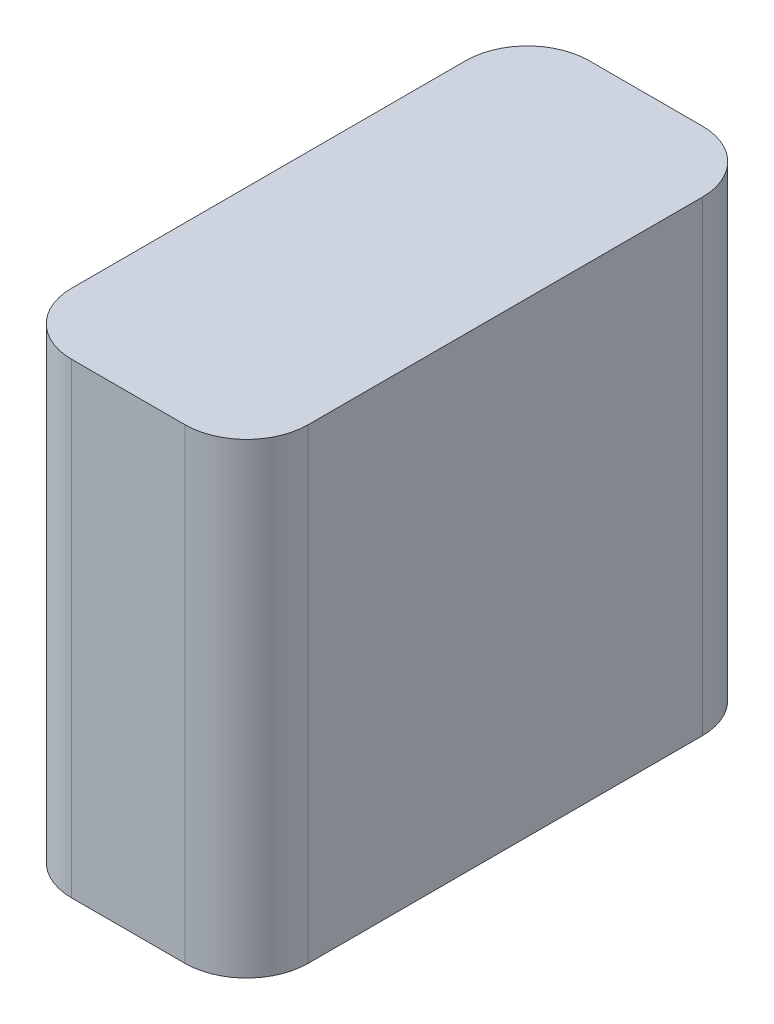
ISO-10303-21;
HEADER;
FILE_DESCRIPTION(('STEP AP214'),'2;1');
FILE_NAME('part.step','',(''),(''),'','','');
FILE_SCHEMA(('AUTOMOTIVE_DESIGN { 1 0 10303 214 1 1 1 1 }'));
ENDSEC;
DATA;
#1=APPLICATION_CONTEXT('core data for automotive mechanical design processes');
#2=APPLICATION_PROTOCOL_DEFINITION('international standard','automotive_design',2000,#1);
#3=PRODUCT_CONTEXT('',#1,'mechanical');
#4=PRODUCT('Part','Part','',(#3));
#5=PRODUCT_RELATED_PRODUCT_CATEGORY('part','',(#4));
#6=PRODUCT_DEFINITION_FORMATION('','',#4);
#7=PRODUCT_DEFINITION_CONTEXT('part definition',#1,'design');
#8=PRODUCT_DEFINITION('design','',#6,#7);
#9=PRODUCT_DEFINITION_SHAPE('','',#8);
#10=(LENGTH_UNIT() NAMED_UNIT(*) SI_UNIT(.MILLI.,.METRE.));
#11=(NAMED_UNIT(*) PLANE_ANGLE_UNIT() SI_UNIT($,.RADIAN.));
#12=(NAMED_UNIT(*) SI_UNIT($,.STERADIAN.) SOLID_ANGLE_UNIT());
#13=UNCERTAINTY_MEASURE_WITH_UNIT(LENGTH_MEASURE(1.E-05),#10,'distance_accuracy_value','');
#14=(GEOMETRIC_REPRESENTATION_CONTEXT(3) GLOBAL_UNCERTAINTY_ASSIGNED_CONTEXT((#13)) GLOBAL_UNIT_ASSIGNED_CONTEXT((#10,
#11,#12)) REPRESENTATION_CONTEXT('',''));
#15=CARTESIAN_POINT('',(0.,0.,0.));
#16=DIRECTION('',(0.,0.,1.));
#17=DIRECTION('',(1.,0.,0.));
#18=AXIS2_PLACEMENT_3D('',#15,#16,#17);
#19=CARTESIAN_POINT('',(7.49935000000001,56.7436,55.42915));
#20=DIRECTION('',(0.,-1.,0.));
#21=DIRECTION('',(0.,0.,-1.));
#22=AXIS2_PLACEMENT_3D('',#19,#20,#21);
#23=CYLINDRICAL_SURFACE('',#22,7.49935);
#24=CARTESIAN_POINT('',(7.49935000000001,0.,55.42915));
#25=DIRECTION('',(0.,1.,0.));
#26=DIRECTION('',(0.,0.,1.));
#27=AXIS2_PLACEMENT_3D('',#24,#25,#26);
#28=CIRCLE('',#27,7.49935);
#29=CARTESIAN_POINT('',(0.,0.,55.42915));
#30=VERTEX_POINT('',#29);
#31=CARTESIAN_POINT('',(7.49935000000006,0.,62.9285));
#32=VERTEX_POINT('',#31);
#33=EDGE_CURVE('E133',#30,#32,#28,.T.);
#34=ORIENTED_EDGE('',*,*,#33,.T.);
#35=DIRECTION('',(0.,-1.,0.));
#36=VECTOR('',#35,1.);
#37=CARTESIAN_POINT('',(7.49935000000006,56.7436,62.9285));
#38=LINE('',#37,#36);
#39=CARTESIAN_POINT('',(7.49935000000006,56.7436,62.9285));
#40=VERTEX_POINT('',#39);
#41=EDGE_CURVE('E11',#40,#32,#38,.T.);
#42=ORIENTED_EDGE('',*,*,#41,.F.);
#43=CARTESIAN_POINT('',(7.49935000000001,56.7436,55.42915));
#44=DIRECTION('',(0.,1.,0.));
#45=DIRECTION('',(0.,0.,1.));
#46=AXIS2_PLACEMENT_3D('',#43,#44,#45);
#47=CIRCLE('',#46,7.49935);
#48=CARTESIAN_POINT('',(0.,56.7436,55.42915));
#49=VERTEX_POINT('',#48);
#50=EDGE_CURVE('E147',#49,#40,#47,.T.);
#51=ORIENTED_EDGE('',*,*,#50,.F.);
#52=DIRECTION('',(0.,-1.,0.));
#53=VECTOR('',#52,1.);
#54=CARTESIAN_POINT('',(0.,56.7436,55.42915));
#55=LINE('',#54,#53);
#56=EDGE_CURVE('E129',#49,#30,#55,.T.);
#57=ORIENTED_EDGE('',*,*,#56,.T.);
#58=EDGE_LOOP('',(#34,#42,#51,#57));
#59=FACE_BOUND('',#58,.T.);
#60=ADVANCED_FACE('F37',(#59),#23,.T.);
#61=CARTESIAN_POINT('',(7.49935000000006,56.7436,62.9285));
#62=DIRECTION('',(0.,0.,-1.));
#63=DIRECTION('',(-1.,0.,0.));
#64=AXIS2_PLACEMENT_3D('',#61,#62,#63);
#65=PLANE('',#64);
#66=DIRECTION('',(1.,0.,0.));
#67=VECTOR('',#66,1.);
#68=CARTESIAN_POINT('',(7.49935000000006,0.,62.9285));
#69=LINE('',#68,#67);
#70=CARTESIAN_POINT('',(21.26615,0.,62.9285));
#71=VERTEX_POINT('',#70);
#72=EDGE_CURVE('E136',#32,#71,#69,.T.);
#73=ORIENTED_EDGE('',*,*,#72,.T.);
#74=DIRECTION('',(0.,-1.,0.));
#75=VECTOR('',#74,1.);
#76=CARTESIAN_POINT('',(21.26615,56.7436,62.9285));
#77=LINE('',#76,#75);
#78=CARTESIAN_POINT('',(21.26615,56.7436,62.9285));
#79=VERTEX_POINT('',#78);
#80=EDGE_CURVE('E45',#79,#71,#77,.T.);
#81=ORIENTED_EDGE('',*,*,#80,.F.);
#82=DIRECTION('',(1.,0.,0.));
#83=VECTOR('',#82,1.);
#84=CARTESIAN_POINT('',(7.49935000000006,56.7436,62.9285));
#85=LINE('',#84,#83);
#86=EDGE_CURVE('E96',#40,#79,#85,.T.);
#87=ORIENTED_EDGE('',*,*,#86,.F.);
#88=ORIENTED_EDGE('',*,*,#41,.T.);
#89=EDGE_LOOP('',(#73,#81,#87,#88));
#90=FACE_BOUND('',#89,.T.);
#91=ADVANCED_FACE('F182',(#90),#65,.F.);
#92=CARTESIAN_POINT('',(21.26615,56.7436,55.42915));
#93=DIRECTION('',(0.,-1.,0.));
#94=DIRECTION('',(0.,0.,-1.));
#95=AXIS2_PLACEMENT_3D('',#92,#93,#94);
#96=CYLINDRICAL_SURFACE('',#95,7.49935);
#97=CARTESIAN_POINT('',(21.26615,0.,55.42915));
#98=DIRECTION('',(0.,1.,0.));
#99=DIRECTION('',(0.,0.,1.));
#100=AXIS2_PLACEMENT_3D('',#97,#98,#99);
#101=CIRCLE('',#100,7.49935);
#102=CARTESIAN_POINT('',(28.7655,0.,55.42915));
#103=VERTEX_POINT('',#102);
#104=EDGE_CURVE('E138',#71,#103,#101,.T.);
#105=ORIENTED_EDGE('',*,*,#104,.T.);
#106=DIRECTION('',(0.,-1.,0.));
#107=VECTOR('',#106,1.);
#108=CARTESIAN_POINT('',(28.7655,56.7436,55.42915));
#109=LINE('',#108,#107);
#110=CARTESIAN_POINT('',(28.7655,56.7436,55.42915));
#111=VERTEX_POINT('',#110);
#112=EDGE_CURVE('E154',#111,#103,#109,.T.);
#113=ORIENTED_EDGE('',*,*,#112,.F.);
#114=CARTESIAN_POINT('',(21.26615,56.7436,55.42915));
#115=DIRECTION('',(0.,1.,0.));
#116=DIRECTION('',(0.,0.,1.));
#117=AXIS2_PLACEMENT_3D('',#114,#115,#116);
#118=CIRCLE('',#117,7.49935);
#119=EDGE_CURVE('E162',#79,#111,#118,.T.);
#120=ORIENTED_EDGE('',*,*,#119,.F.);
#121=ORIENTED_EDGE('',*,*,#80,.T.);
#122=EDGE_LOOP('',(#105,#113,#120,#121));
#123=FACE_BOUND('',#122,.T.);
#124=ADVANCED_FACE('F160',(#123),#96,.T.);
#125=CARTESIAN_POINT('',(28.7655,56.7436,7.49935000000005));
#126=DIRECTION('',(-1.,0.,0.));
#127=DIRECTION('',(0.,0.,1.));
#128=AXIS2_PLACEMENT_3D('',#125,#126,#127);
#129=PLANE('',#128);
#130=DIRECTION('',(0.,0.,-1.));
#131=VECTOR('',#130,1.);
#132=CARTESIAN_POINT('',(28.7655,0.,7.49935000000005));
#133=LINE('',#132,#131);
#134=CARTESIAN_POINT('',(28.7655,0.,7.49935000000005));
#135=VERTEX_POINT('',#134);
#136=EDGE_CURVE('E140',#103,#135,#133,.T.);
#137=ORIENTED_EDGE('',*,*,#136,.T.);
#138=DIRECTION('',(0.,-1.,0.));
#139=VECTOR('',#138,1.);
#140=CARTESIAN_POINT('',(28.7655,56.7436,7.49935000000005));
#141=LINE('',#140,#139);
#142=CARTESIAN_POINT('',(28.7655,56.7436,7.49935000000005));
#143=VERTEX_POINT('',#142);
#144=EDGE_CURVE('E151',#143,#135,#141,.T.);
#145=ORIENTED_EDGE('',*,*,#144,.F.);
#146=DIRECTION('',(0.,0.,-1.));
#147=VECTOR('',#146,1.);
#148=CARTESIAN_POINT('',(28.7655,56.7436,7.49935000000005));
#149=LINE('',#148,#147);
#150=EDGE_CURVE('E174',#111,#143,#149,.T.);
#151=ORIENTED_EDGE('',*,*,#150,.F.);
#152=ORIENTED_EDGE('',*,*,#112,.T.);
#153=EDGE_LOOP('',(#137,#145,#151,#152));
#154=FACE_BOUND('',#153,.T.);
#155=ADVANCED_FACE('F170',(#154),#129,.F.);
#156=CARTESIAN_POINT('',(21.26615,56.7436,7.49935));
#157=DIRECTION('',(0.,-1.,0.));
#158=DIRECTION('',(0.,0.,-1.));
#159=AXIS2_PLACEMENT_3D('',#156,#157,#158);
#160=CYLINDRICAL_SURFACE('',#159,7.49935);
#161=CARTESIAN_POINT('',(21.26615,0.,7.49935));
#162=DIRECTION('',(0.,1.,0.));
#163=DIRECTION('',(0.,0.,-1.));
#164=AXIS2_PLACEMENT_3D('',#161,#162,#163);
#165=CIRCLE('',#164,7.49935);
#166=CARTESIAN_POINT('',(21.2661499999999,0.,0.));
#167=VERTEX_POINT('',#166);
#168=EDGE_CURVE('E142',#135,#167,#165,.T.);
#169=ORIENTED_EDGE('',*,*,#168,.T.);
#170=DIRECTION('',(0.,-1.,0.));
#171=VECTOR('',#170,1.);
#172=CARTESIAN_POINT('',(21.2661499999999,56.7436,0.));
#173=LINE('',#172,#171);
#174=CARTESIAN_POINT('',(21.2661499999999,56.7436,0.));
#175=VERTEX_POINT('',#174);
#176=EDGE_CURVE('E124',#175,#167,#173,.T.);
#177=ORIENTED_EDGE('',*,*,#176,.F.);
#178=CARTESIAN_POINT('',(21.26615,56.7436,7.49935));
#179=DIRECTION('',(0.,1.,0.));
#180=DIRECTION('',(0.,0.,-1.));
#181=AXIS2_PLACEMENT_3D('',#178,#179,#180);
#182=CIRCLE('',#181,7.49935);
#183=EDGE_CURVE('E115',#143,#175,#182,.T.);
#184=ORIENTED_EDGE('',*,*,#183,.F.);
#185=ORIENTED_EDGE('',*,*,#144,.T.);
#186=EDGE_LOOP('',(#169,#177,#184,#185));
#187=FACE_BOUND('',#186,.T.);
#188=ADVANCED_FACE('F173',(#187),#160,.T.);
#189=CARTESIAN_POINT('',(7.49935000000005,56.7436,0.));
#190=DIRECTION('',(0.,0.,1.));
#191=DIRECTION('',(1.,0.,0.));
#192=AXIS2_PLACEMENT_3D('',#189,#190,#191);
#193=PLANE('',#192);
#194=DIRECTION('',(-1.,0.,0.));
#195=VECTOR('',#194,1.);
#196=CARTESIAN_POINT('',(7.49935000000005,0.,0.));
#197=LINE('',#196,#195);
#198=CARTESIAN_POINT('',(7.49935000000005,0.,0.));
#199=VERTEX_POINT('',#198);
#200=EDGE_CURVE('E123',#167,#199,#197,.T.);
#201=ORIENTED_EDGE('',*,*,#200,.T.);
#202=DIRECTION('',(0.,-1.,0.));
#203=VECTOR('',#202,1.);
#204=CARTESIAN_POINT('',(7.49935000000005,56.7436,0.));
#205=LINE('',#204,#203);
#206=CARTESIAN_POINT('',(7.49935000000005,56.7436,0.));
#207=VERTEX_POINT('',#206);
#208=EDGE_CURVE('E120',#207,#199,#205,.T.);
#209=ORIENTED_EDGE('',*,*,#208,.F.);
#210=DIRECTION('',(-1.,0.,0.));
#211=VECTOR('',#210,1.);
#212=CARTESIAN_POINT('',(7.49935000000005,56.7436,0.));
#213=LINE('',#212,#211);
#214=EDGE_CURVE('E109',#175,#207,#213,.T.);
#215=ORIENTED_EDGE('',*,*,#214,.F.);
#216=ORIENTED_EDGE('',*,*,#176,.T.);
#217=EDGE_LOOP('',(#201,#209,#215,#216));
#218=FACE_BOUND('',#217,.T.);
#219=ADVANCED_FACE('F121',(#218),#193,.F.);
#220=CARTESIAN_POINT('',(7.49935,56.7436,7.49935));
#221=DIRECTION('',(0.,-1.,0.));
#222=DIRECTION('',(0.,0.,-1.));
#223=AXIS2_PLACEMENT_3D('',#220,#221,#222);
#224=CYLINDRICAL_SURFACE('',#223,7.49935);
#225=CARTESIAN_POINT('',(7.49935,0.,7.49935));
#226=DIRECTION('',(0.,1.,0.));
#227=DIRECTION('',(0.,0.,1.));
#228=AXIS2_PLACEMENT_3D('',#225,#226,#227);
#229=CIRCLE('',#228,7.49935);
#230=CARTESIAN_POINT('',(0.,0.,7.49935000000005));
#231=VERTEX_POINT('',#230);
#232=EDGE_CURVE('E82',#199,#231,#229,.T.);
#233=ORIENTED_EDGE('',*,*,#232,.T.);
#234=DIRECTION('',(0.,-1.,0.));
#235=VECTOR('',#234,1.);
#236=CARTESIAN_POINT('',(0.,56.7436,7.49935000000005));
#237=LINE('',#236,#235);
#238=CARTESIAN_POINT('',(0.,56.7436,7.49935000000005));
#239=VERTEX_POINT('',#238);
#240=EDGE_CURVE('E125',#239,#231,#237,.T.);
#241=ORIENTED_EDGE('',*,*,#240,.F.);
#242=CARTESIAN_POINT('',(7.49935,56.7436,7.49935));
#243=DIRECTION('',(0.,1.,0.));
#244=DIRECTION('',(0.,0.,1.));
#245=AXIS2_PLACEMENT_3D('',#242,#243,#244);
#246=CIRCLE('',#245,7.49935);
#247=EDGE_CURVE('E113',#207,#239,#246,.T.);
#248=ORIENTED_EDGE('',*,*,#247,.F.);
#249=ORIENTED_EDGE('',*,*,#208,.T.);
#250=EDGE_LOOP('',(#233,#241,#248,#249));
#251=FACE_BOUND('',#250,.T.);
#252=ADVANCED_FACE('F127',(#251),#224,.T.);
#253=CARTESIAN_POINT('',(0.,56.7436,7.49935000000005));
#254=DIRECTION('',(1.,0.,0.));
#255=DIRECTION('',(0.,0.,-1.));
#256=AXIS2_PLACEMENT_3D('',#253,#254,#255);
#257=PLANE('',#256);
#258=DIRECTION('',(0.,0.,1.));
#259=VECTOR('',#258,1.);
#260=CARTESIAN_POINT('',(0.,0.,7.49935000000005));
#261=LINE('',#260,#259);
#262=EDGE_CURVE('E88',#231,#30,#261,.T.);
#263=ORIENTED_EDGE('',*,*,#262,.T.);
#264=ORIENTED_EDGE('',*,*,#56,.F.);
#265=DIRECTION('',(0.,0.,1.));
#266=VECTOR('',#265,1.);
#267=CARTESIAN_POINT('',(0.,56.7436,7.49935000000005));
#268=LINE('',#267,#266);
#269=EDGE_CURVE('E53',#239,#49,#268,.T.);
#270=ORIENTED_EDGE('',*,*,#269,.F.);
#271=ORIENTED_EDGE('',*,*,#240,.T.);
#272=EDGE_LOOP('',(#263,#264,#270,#271));
#273=FACE_BOUND('',#272,.T.);
#274=ADVANCED_FACE('F198',(#273),#257,.F.);
#275=CARTESIAN_POINT('',(7.49935000000001,56.7436,55.42915));
#276=DIRECTION('',(0.,1.,0.));
#277=DIRECTION('',(0.,0.,1.));
#278=AXIS2_PLACEMENT_3D('',#275,#276,#277);
#279=PLANE('',#278);
#280=ORIENTED_EDGE('',*,*,#50,.T.);
#281=ORIENTED_EDGE('',*,*,#86,.T.);
#282=ORIENTED_EDGE('',*,*,#119,.T.);
#283=ORIENTED_EDGE('',*,*,#150,.T.);
#284=ORIENTED_EDGE('',*,*,#183,.T.);
#285=ORIENTED_EDGE('',*,*,#214,.T.);
#286=ORIENTED_EDGE('',*,*,#247,.T.);
#287=ORIENTED_EDGE('',*,*,#269,.T.);
#288=EDGE_LOOP('',(#280,#281,#282,#283,#284,#285,#286,#287));
#289=FACE_BOUND('',#288,.T.);
#290=ADVANCED_FACE('F111',(#289),#279,.T.);
#291=CARTESIAN_POINT('',(7.49935000000001,0.,55.42915));
#292=DIRECTION('',(0.,1.,0.));
#293=DIRECTION('',(0.,0.,1.));
#294=AXIS2_PLACEMENT_3D('',#291,#292,#293);
#295=PLANE('',#294);
#296=ORIENTED_EDGE('',*,*,#33,.F.);
#297=ORIENTED_EDGE('',*,*,#262,.F.);
#298=ORIENTED_EDGE('',*,*,#232,.F.);
#299=ORIENTED_EDGE('',*,*,#200,.F.);
#300=ORIENTED_EDGE('',*,*,#168,.F.);
#301=ORIENTED_EDGE('',*,*,#136,.F.);
#302=ORIENTED_EDGE('',*,*,#104,.F.);
#303=ORIENTED_EDGE('',*,*,#72,.F.);
#304=EDGE_LOOP('',(#296,#297,#298,#299,#300,#301,#302,#303));
#305=FACE_BOUND('',#304,.T.);
#306=ADVANCED_FACE('F166',(#305),#295,.F.);
#307=CLOSED_SHELL('',(#60,#91,#124,#155,#188,#219,#252,#274,#290,#306));
#308=MANIFOLD_SOLID_BREP('B2',#307);
#309=ADVANCED_BREP_SHAPE_REPRESENTATION('',(#18,#308),#14);
#310=SHAPE_DEFINITION_REPRESENTATION(#9,#309);
ENDSEC;
END-ISO-10303-21;
